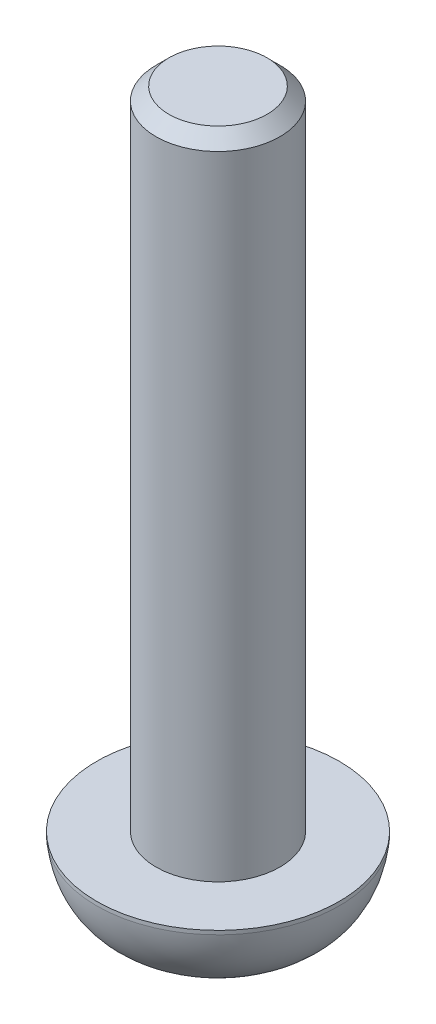
ISO-10303-21;
HEADER;
FILE_DESCRIPTION(('STEP AP214'),'2;1');
FILE_NAME('part.step','',(''),(''),'','','');
FILE_SCHEMA(('AUTOMOTIVE_DESIGN { 1 0 10303 214 1 1 1 1 }'));
ENDSEC;
DATA;
#1=APPLICATION_CONTEXT('core data for automotive mechanical design processes');
#2=APPLICATION_PROTOCOL_DEFINITION('international standard','automotive_design',2000,#1);
#3=PRODUCT_CONTEXT('',#1,'mechanical');
#4=PRODUCT('Part','Part','',(#3));
#5=PRODUCT_RELATED_PRODUCT_CATEGORY('part','',(#4));
#6=PRODUCT_DEFINITION_FORMATION('','',#4);
#7=PRODUCT_DEFINITION_CONTEXT('part definition',#1,'design');
#8=PRODUCT_DEFINITION('design','',#6,#7);
#9=PRODUCT_DEFINITION_SHAPE('','',#8);
#10=(LENGTH_UNIT() NAMED_UNIT(*) SI_UNIT(.MILLI.,.METRE.));
#11=(NAMED_UNIT(*) PLANE_ANGLE_UNIT() SI_UNIT($,.RADIAN.));
#12=(NAMED_UNIT(*) SI_UNIT($,.STERADIAN.) SOLID_ANGLE_UNIT());
#13=UNCERTAINTY_MEASURE_WITH_UNIT(LENGTH_MEASURE(1.E-05),#10,'distance_accuracy_value','');
#14=(GEOMETRIC_REPRESENTATION_CONTEXT(3) GLOBAL_UNCERTAINTY_ASSIGNED_CONTEXT((#13)) GLOBAL_UNIT_ASSIGNED_CONTEXT((#10,
#11,#12)) REPRESENTATION_CONTEXT('',''));
#15=CARTESIAN_POINT('',(0.,0.,0.));
#16=DIRECTION('',(0.,0.,1.));
#17=DIRECTION('',(1.,0.,0.));
#18=AXIS2_PLACEMENT_3D('',#15,#16,#17);
#19=CARTESIAN_POINT('',(0.,3.,0.));
#20=DIRECTION('',(0.,-1.,0.));
#21=DIRECTION('',(0.,0.,-1.));
#22=AXIS2_PLACEMENT_3D('',#19,#20,#21);
#23=CYLINDRICAL_SURFACE('',#22,4.7);
#24=CARTESIAN_POINT('',(0.,2.85,0.));
#25=DIRECTION('',(0.,-1.,0.));
#26=DIRECTION('',(0.,0.,-1.));
#27=AXIS2_PLACEMENT_3D('',#24,#25,#26);
#28=CIRCLE('',#27,4.7);
#29=CARTESIAN_POINT('',(0.,2.85,-4.7));
#30=VERTEX_POINT('',#29);
#31=EDGE_CURVE('E205',#30,#30,#28,.T.);
#32=ORIENTED_EDGE('',*,*,#31,.F.);
#33=EDGE_LOOP('',(#32));
#34=FACE_BOUND('',#33,.T.);
#35=CARTESIAN_POINT('',(0.,3.,0.));
#36=DIRECTION('',(0.,1.,0.));
#37=DIRECTION('',(0.,0.,1.));
#38=AXIS2_PLACEMENT_3D('',#35,#36,#37);
#39=CIRCLE('',#38,4.7);
#40=CARTESIAN_POINT('',(0.,3.,4.7));
#41=VERTEX_POINT('',#40);
#42=EDGE_CURVE('E208',#41,#41,#39,.T.);
#43=ORIENTED_EDGE('',*,*,#42,.F.);
#44=EDGE_LOOP('',(#43));
#45=FACE_BOUND('',#44,.T.);
#46=ADVANCED_FACE('F44',(#34,#45),#23,.T.);
#47=CARTESIAN_POINT('',(0.,3.,0.));
#48=DIRECTION('',(0.,1.,0.));
#49=DIRECTION('',(0.,0.,1.));
#50=AXIS2_PLACEMENT_3D('',#47,#48,#49);
#51=PLANE('',#50);
#52=CARTESIAN_POINT('',(0.,3.,0.));
#53=DIRECTION('',(0.,1.,0.));
#54=DIRECTION('',(0.,0.,1.));
#55=AXIS2_PLACEMENT_3D('',#52,#53,#54);
#56=CIRCLE('',#55,2.4);
#57=CARTESIAN_POINT('',(0.,3.,2.4));
#58=VERTEX_POINT('',#57);
#59=EDGE_CURVE('E211',#58,#58,#56,.T.);
#60=ORIENTED_EDGE('',*,*,#59,.F.);
#61=EDGE_LOOP('',(#60));
#62=FACE_BOUND('',#61,.T.);
#63=ORIENTED_EDGE('',*,*,#42,.T.);
#64=EDGE_LOOP('',(#63));
#65=FACE_BOUND('',#64,.T.);
#66=ADVANCED_FACE('F190',(#62,#65),#51,.T.);
#67=CARTESIAN_POINT('',(0.,28.,0.));
#68=DIRECTION('',(0.,-1.,0.));
#69=DIRECTION('',(0.,0.,-1.));
#70=AXIS2_PLACEMENT_3D('',#67,#68,#69);
#71=CYLINDRICAL_SURFACE('',#70,2.4);
#72=CARTESIAN_POINT('',(0.,27.5,0.));
#73=DIRECTION('',(0.,1.,0.));
#74=DIRECTION('',(0.,0.,1.));
#75=AXIS2_PLACEMENT_3D('',#72,#73,#74);
#76=CIRCLE('',#75,2.4);
#77=CARTESIAN_POINT('',(0.,27.5,2.4));
#78=VERTEX_POINT('',#77);
#79=EDGE_CURVE('E11',#78,#78,#76,.F.);
#80=ORIENTED_EDGE('',*,*,#79,.T.);
#81=EDGE_LOOP('',(#80));
#82=FACE_BOUND('',#81,.T.);
#83=ORIENTED_EDGE('',*,*,#59,.T.);
#84=EDGE_LOOP('',(#83));
#85=FACE_BOUND('',#84,.T.);
#86=ADVANCED_FACE('F186',(#82,#85),#71,.T.);
#87=CARTESIAN_POINT('',(0.,28.,0.));
#88=DIRECTION('',(0.,1.,0.));
#89=DIRECTION('',(0.,0.,1.));
#90=AXIS2_PLACEMENT_3D('',#87,#88,#89);
#91=PLANE('',#90);
#92=CARTESIAN_POINT('',(0.,28.,0.));
#93=DIRECTION('',(0.,1.,0.));
#94=DIRECTION('',(0.,0.,1.));
#95=AXIS2_PLACEMENT_3D('',#92,#93,#94);
#96=CIRCLE('',#95,1.9);
#97=CARTESIAN_POINT('',(0.,28.,1.9));
#98=VERTEX_POINT('',#97);
#99=EDGE_CURVE('E54',#98,#98,#96,.T.);
#100=ORIENTED_EDGE('',*,*,#99,.T.);
#101=EDGE_LOOP('',(#100));
#102=FACE_BOUND('',#101,.T.);
#103=ADVANCED_FACE('F180',(#102),#91,.T.);
#104=CARTESIAN_POINT('',(4.7,2.85,0.));
#105=CARTESIAN_POINT('',(4.43246222771423,0.599611143243104,0.));
#106=CARTESIAN_POINT('',(2.35,0.,0.));
#107=B_SPLINE_CURVE_WITH_KNOTS('',2,(#104,#105,#106),.UNSPECIFIED.,.F.,.F.,(3,3),(0.,1.),.UNSPECIFIED.);
#108=CARTESIAN_POINT('',(0.,0.,0.));
#109=DIRECTION('',(0.,-1.,0.));
#110=AXIS1_PLACEMENT('',#108,#109);
#111=SURFACE_OF_REVOLUTION('',#107,#110);
#112=CARTESIAN_POINT('',(0.,0.,0.));
#113=DIRECTION('',(0.,-1.,0.));
#114=DIRECTION('',(0.,0.,-1.));
#115=AXIS2_PLACEMENT_3D('',#112,#113,#114);
#116=CIRCLE('',#115,2.35);
#117=CARTESIAN_POINT('',(0.,0.,-2.35));
#118=VERTEX_POINT('',#117);
#119=EDGE_CURVE('E159',#118,#118,#116,.T.);
#120=ORIENTED_EDGE('',*,*,#119,.F.);
#121=EDGE_LOOP('',(#120));
#122=FACE_BOUND('',#121,.T.);
#123=ORIENTED_EDGE('',*,*,#31,.T.);
#124=EDGE_LOOP('',(#123));
#125=FACE_BOUND('',#124,.T.);
#126=ADVANCED_FACE('F175',(#122,#125),#111,.T.);
#127=CARTESIAN_POINT('',(0.,0.,0.));
#128=DIRECTION('',(0.,1.,0.));
#129=DIRECTION('',(0.,0.,1.));
#130=AXIS2_PLACEMENT_3D('',#127,#128,#129);
#131=PLANE('',#130);
#132=DIRECTION('',(-0.866025403784439,0.,-0.5));
#133=VECTOR('',#132,1.);
#134=CARTESIAN_POINT('',(0.,0.,1.73205080756888));
#135=LINE('',#134,#133);
#136=CARTESIAN_POINT('',(0.,0.,1.73205080756888));
#137=VERTEX_POINT('',#136);
#138=CARTESIAN_POINT('',(-1.5,0.,0.866025403784439));
#139=VERTEX_POINT('',#138);
#140=EDGE_CURVE('E141',#137,#139,#135,.T.);
#141=ORIENTED_EDGE('',*,*,#140,.F.);
#142=DIRECTION('',(-0.866025403784439,0.,0.5));
#143=VECTOR('',#142,1.);
#144=CARTESIAN_POINT('',(1.5,0.,0.86602540378444));
#145=LINE('',#144,#143);
#146=CARTESIAN_POINT('',(1.5,0.,0.86602540378444));
#147=VERTEX_POINT('',#146);
#148=EDGE_CURVE('E61',#147,#137,#145,.T.);
#149=ORIENTED_EDGE('',*,*,#148,.F.);
#150=DIRECTION('',(0.,0.,1.));
#151=VECTOR('',#150,1.);
#152=CARTESIAN_POINT('',(1.5,0.,-0.866025403784439));
#153=LINE('',#152,#151);
#154=CARTESIAN_POINT('',(1.5,0.,-0.866025403784439));
#155=VERTEX_POINT('',#154);
#156=EDGE_CURVE('E153',#155,#147,#153,.T.);
#157=ORIENTED_EDGE('',*,*,#156,.F.);
#158=DIRECTION('',(0.866025403784439,0.,0.5));
#159=VECTOR('',#158,1.);
#160=CARTESIAN_POINT('',(0.,0.,-1.73205080756888));
#161=LINE('',#160,#159);
#162=CARTESIAN_POINT('',(0.,0.,-1.73205080756888));
#163=VERTEX_POINT('',#162);
#164=EDGE_CURVE('E151',#163,#155,#161,.T.);
#165=ORIENTED_EDGE('',*,*,#164,.F.);
#166=DIRECTION('',(0.866025403784438,0.,-0.5));
#167=VECTOR('',#166,1.);
#168=CARTESIAN_POINT('',(-1.5,0.,-0.866025403784438));
#169=LINE('',#168,#167);
#170=CARTESIAN_POINT('',(-1.5,0.,-0.866025403784438));
#171=VERTEX_POINT('',#170);
#172=EDGE_CURVE('E109',#171,#163,#169,.T.);
#173=ORIENTED_EDGE('',*,*,#172,.F.);
#174=DIRECTION('',(0.,0.,-1.));
#175=VECTOR('',#174,1.);
#176=CARTESIAN_POINT('',(-1.5,0.,0.866025403784439));
#177=LINE('',#176,#175);
#178=EDGE_CURVE('E145',#139,#171,#177,.T.);
#179=ORIENTED_EDGE('',*,*,#178,.F.);
#180=EDGE_LOOP('',(#141,#149,#157,#165,#173,#179));
#181=FACE_BOUND('',#180,.T.);
#182=ORIENTED_EDGE('',*,*,#119,.T.);
#183=EDGE_LOOP('',(#182));
#184=FACE_BOUND('',#183,.T.);
#185=ADVANCED_FACE('F179',(#181,#184),#131,.F.);
#186=CARTESIAN_POINT('',(1.5,1.5,0.86602540378444));
#187=DIRECTION('',(0.5,0.,0.866025403784439));
#188=DIRECTION('',(0.866025403784439,0.,-0.5));
#189=AXIS2_PLACEMENT_3D('',#186,#187,#188);
#190=PLANE('',#189);
#191=ORIENTED_EDGE('',*,*,#148,.T.);
#192=DIRECTION('',(0.,-1.,0.));
#193=VECTOR('',#192,1.);
#194=CARTESIAN_POINT('',(0.,1.5,1.73205080756888));
#195=LINE('',#194,#193);
#196=CARTESIAN_POINT('',(0.,1.5,1.73205080756888));
#197=VERTEX_POINT('',#196);
#198=EDGE_CURVE('E91',#197,#137,#195,.T.);
#199=ORIENTED_EDGE('',*,*,#198,.F.);
#200=DIRECTION('',(-0.866025403784439,0.,0.5));
#201=VECTOR('',#200,1.);
#202=CARTESIAN_POINT('',(1.5,1.5,0.86602540378444));
#203=LINE('',#202,#201);
#204=CARTESIAN_POINT('',(1.5,1.5,0.86602540378444));
#205=VERTEX_POINT('',#204);
#206=EDGE_CURVE('E156',#205,#197,#203,.T.);
#207=ORIENTED_EDGE('',*,*,#206,.F.);
#208=DIRECTION('',(0.,-1.,0.));
#209=VECTOR('',#208,1.);
#210=CARTESIAN_POINT('',(1.5,1.5,0.86602540378444));
#211=LINE('',#210,#209);
#212=EDGE_CURVE('E69',#205,#147,#211,.T.);
#213=ORIENTED_EDGE('',*,*,#212,.T.);
#214=EDGE_LOOP('',(#191,#199,#207,#213));
#215=FACE_BOUND('',#214,.T.);
#216=ADVANCED_FACE('F182',(#215),#190,.F.);
#217=CARTESIAN_POINT('',(1.5,1.5,-0.866025403784439));
#218=DIRECTION('',(1.,0.,0.));
#219=DIRECTION('',(0.,0.,-1.));
#220=AXIS2_PLACEMENT_3D('',#217,#218,#219);
#221=PLANE('',#220);
#222=ORIENTED_EDGE('',*,*,#156,.T.);
#223=ORIENTED_EDGE('',*,*,#212,.F.);
#224=DIRECTION('',(0.,0.,1.));
#225=VECTOR('',#224,1.);
#226=CARTESIAN_POINT('',(1.5,1.5,-0.866025403784439));
#227=LINE('',#226,#225);
#228=CARTESIAN_POINT('',(1.5,1.5,-0.866025403784439));
#229=VERTEX_POINT('',#228);
#230=EDGE_CURVE('E121',#229,#205,#227,.T.);
#231=ORIENTED_EDGE('',*,*,#230,.F.);
#232=DIRECTION('',(0.,-1.,0.));
#233=VECTOR('',#232,1.);
#234=CARTESIAN_POINT('',(1.5,1.5,-0.866025403784439));
#235=LINE('',#234,#233);
#236=EDGE_CURVE('E113',#229,#155,#235,.T.);
#237=ORIENTED_EDGE('',*,*,#236,.T.);
#238=EDGE_LOOP('',(#222,#223,#231,#237));
#239=FACE_BOUND('',#238,.T.);
#240=ADVANCED_FACE('F241',(#239),#221,.F.);
#241=CARTESIAN_POINT('',(0.,1.5,-1.73205080756888));
#242=DIRECTION('',(0.5,0.,-0.866025403784439));
#243=DIRECTION('',(-0.866025403784439,0.,-0.5));
#244=AXIS2_PLACEMENT_3D('',#241,#242,#243);
#245=PLANE('',#244);
#246=ORIENTED_EDGE('',*,*,#164,.T.);
#247=ORIENTED_EDGE('',*,*,#236,.F.);
#248=DIRECTION('',(0.866025403784439,0.,0.5));
#249=VECTOR('',#248,1.);
#250=CARTESIAN_POINT('',(0.,1.5,-1.73205080756888));
#251=LINE('',#250,#249);
#252=CARTESIAN_POINT('',(0.,1.5,-1.73205080756888));
#253=VERTEX_POINT('',#252);
#254=EDGE_CURVE('E117',#253,#229,#251,.T.);
#255=ORIENTED_EDGE('',*,*,#254,.F.);
#256=DIRECTION('',(0.,-1.,0.));
#257=VECTOR('',#256,1.);
#258=CARTESIAN_POINT('',(0.,1.5,-1.73205080756888));
#259=LINE('',#258,#257);
#260=EDGE_CURVE('E102',#253,#163,#259,.T.);
#261=ORIENTED_EDGE('',*,*,#260,.T.);
#262=EDGE_LOOP('',(#246,#247,#255,#261));
#263=FACE_BOUND('',#262,.T.);
#264=ADVANCED_FACE('F118',(#263),#245,.F.);
#265=CARTESIAN_POINT('',(-1.5,1.5,-0.866025403784438));
#266=DIRECTION('',(-0.5,0.,-0.866025403784439));
#267=DIRECTION('',(-0.866025403784439,0.,0.5));
#268=AXIS2_PLACEMENT_3D('',#265,#266,#267);
#269=PLANE('',#268);
#270=ORIENTED_EDGE('',*,*,#172,.T.);
#271=ORIENTED_EDGE('',*,*,#260,.F.);
#272=DIRECTION('',(0.866025403784438,0.,-0.5));
#273=VECTOR('',#272,1.);
#274=CARTESIAN_POINT('',(-1.5,1.5,-0.866025403784438));
#275=LINE('',#274,#273);
#276=CARTESIAN_POINT('',(-1.5,1.5,-0.866025403784438));
#277=VERTEX_POINT('',#276);
#278=EDGE_CURVE('E106',#277,#253,#275,.T.);
#279=ORIENTED_EDGE('',*,*,#278,.F.);
#280=DIRECTION('',(0.,-1.,0.));
#281=VECTOR('',#280,1.);
#282=CARTESIAN_POINT('',(-1.5,1.5,-0.866025403784438));
#283=LINE('',#282,#281);
#284=EDGE_CURVE('E114',#277,#171,#283,.T.);
#285=ORIENTED_EDGE('',*,*,#284,.T.);
#286=EDGE_LOOP('',(#270,#271,#279,#285));
#287=FACE_BOUND('',#286,.T.);
#288=ADVANCED_FACE('F104',(#287),#269,.F.);
#289=CARTESIAN_POINT('',(-1.5,1.5,0.866025403784439));
#290=DIRECTION('',(-1.,0.,0.));
#291=DIRECTION('',(0.,0.,1.));
#292=AXIS2_PLACEMENT_3D('',#289,#290,#291);
#293=PLANE('',#292);
#294=ORIENTED_EDGE('',*,*,#178,.T.);
#295=ORIENTED_EDGE('',*,*,#284,.F.);
#296=DIRECTION('',(0.,0.,-1.));
#297=VECTOR('',#296,1.);
#298=CARTESIAN_POINT('',(-1.5,1.5,0.866025403784439));
#299=LINE('',#298,#297);
#300=CARTESIAN_POINT('',(-1.5,1.5,0.866025403784439));
#301=VERTEX_POINT('',#300);
#302=EDGE_CURVE('E127',#301,#277,#299,.T.);
#303=ORIENTED_EDGE('',*,*,#302,.F.);
#304=DIRECTION('',(0.,-1.,0.));
#305=VECTOR('',#304,1.);
#306=CARTESIAN_POINT('',(-1.5,1.5,0.866025403784439));
#307=LINE('',#306,#305);
#308=EDGE_CURVE('E162',#301,#139,#307,.T.);
#309=ORIENTED_EDGE('',*,*,#308,.T.);
#310=EDGE_LOOP('',(#294,#295,#303,#309));
#311=FACE_BOUND('',#310,.T.);
#312=ADVANCED_FACE('F238',(#311),#293,.F.);
#313=CARTESIAN_POINT('',(0.,1.5,1.73205080756888));
#314=DIRECTION('',(-0.5,0.,0.866025403784439));
#315=DIRECTION('',(0.866025403784439,0.,0.5));
#316=AXIS2_PLACEMENT_3D('',#313,#314,#315);
#317=PLANE('',#316);
#318=ORIENTED_EDGE('',*,*,#140,.T.);
#319=ORIENTED_EDGE('',*,*,#308,.F.);
#320=DIRECTION('',(-0.866025403784439,0.,-0.5));
#321=VECTOR('',#320,1.);
#322=CARTESIAN_POINT('',(0.,1.5,1.73205080756888));
#323=LINE('',#322,#321);
#324=EDGE_CURVE('E133',#197,#301,#323,.T.);
#325=ORIENTED_EDGE('',*,*,#324,.F.);
#326=ORIENTED_EDGE('',*,*,#198,.T.);
#327=EDGE_LOOP('',(#318,#319,#325,#326));
#328=FACE_BOUND('',#327,.T.);
#329=ADVANCED_FACE('F228',(#328),#317,.F.);
#330=CARTESIAN_POINT('',(0.,1.5,0.));
#331=DIRECTION('',(0.,-1.,0.));
#332=DIRECTION('',(0.,0.,-1.));
#333=AXIS2_PLACEMENT_3D('',#330,#331,#332);
#334=PLANE('',#333);
#335=ORIENTED_EDGE('',*,*,#206,.T.);
#336=ORIENTED_EDGE('',*,*,#324,.T.);
#337=ORIENTED_EDGE('',*,*,#302,.T.);
#338=ORIENTED_EDGE('',*,*,#278,.T.);
#339=ORIENTED_EDGE('',*,*,#254,.T.);
#340=ORIENTED_EDGE('',*,*,#230,.T.);
#341=EDGE_LOOP('',(#335,#336,#337,#338,#339,#340));
#342=FACE_BOUND('',#341,.T.);
#343=ADVANCED_FACE('F124',(#342),#334,.T.);
#344=CARTESIAN_POINT('',(0.,28.,0.));
#345=DIRECTION('',(0.,-1.,0.));
#346=DIRECTION('',(0.,0.,-1.));
#347=AXIS2_PLACEMENT_3D('',#344,#345,#346);
#348=CONICAL_SURFACE('',#347,1.9,0.785398163397442);
#349=ORIENTED_EDGE('',*,*,#79,.F.);
#350=EDGE_LOOP('',(#349));
#351=FACE_BOUND('',#350,.T.);
#352=ORIENTED_EDGE('',*,*,#99,.F.);
#353=EDGE_LOOP('',(#352));
#354=FACE_BOUND('',#353,.T.);
#355=ADVANCED_FACE('F47',(#351,#354),#348,.T.);
#356=CLOSED_SHELL('',(#46,#66,#86,#103,#126,#185,#216,#240,#264,#288,#312,#329,#343,#355));
#357=MANIFOLD_SOLID_BREP('B2',#356);
#358=ADVANCED_BREP_SHAPE_REPRESENTATION('',(#18,#357),#14);
#359=SHAPE_DEFINITION_REPRESENTATION(#9,#358);
ENDSEC;
END-ISO-10303-21;
